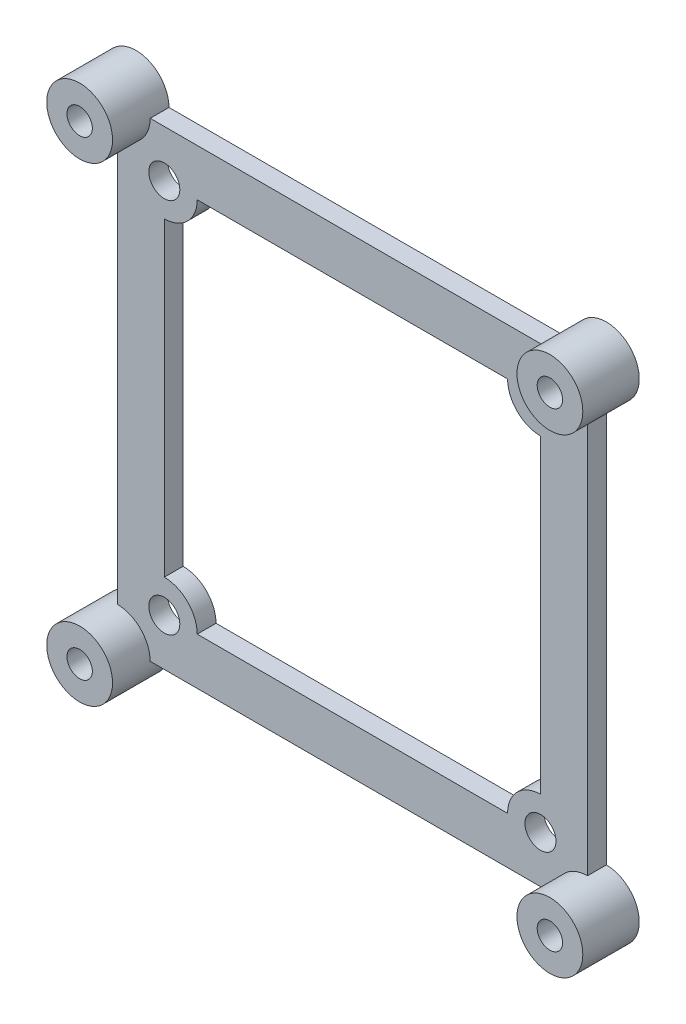
ISO-10303-21;
HEADER;
FILE_DESCRIPTION(('STEP AP214'),'2;1');
FILE_NAME('part.step','',(''),(''),'','','');
FILE_SCHEMA(('AUTOMOTIVE_DESIGN { 1 0 10303 214 1 1 1 1 }'));
ENDSEC;
DATA;
#1=APPLICATION_CONTEXT('core data for automotive mechanical design processes');
#2=APPLICATION_PROTOCOL_DEFINITION('international standard','automotive_design',2000,#1);
#3=PRODUCT_CONTEXT('',#1,'mechanical');
#4=PRODUCT('Part','Part','',(#3));
#5=PRODUCT_RELATED_PRODUCT_CATEGORY('part','',(#4));
#6=PRODUCT_DEFINITION_FORMATION('','',#4);
#7=PRODUCT_DEFINITION_CONTEXT('part definition',#1,'design');
#8=PRODUCT_DEFINITION('design','',#6,#7);
#9=PRODUCT_DEFINITION_SHAPE('','',#8);
#10=(LENGTH_UNIT() NAMED_UNIT(*) SI_UNIT(.MILLI.,.METRE.));
#11=(NAMED_UNIT(*) PLANE_ANGLE_UNIT() SI_UNIT($,.RADIAN.));
#12=(NAMED_UNIT(*) SI_UNIT($,.STERADIAN.) SOLID_ANGLE_UNIT());
#13=UNCERTAINTY_MEASURE_WITH_UNIT(LENGTH_MEASURE(1.E-05),#10,'distance_accuracy_value','');
#14=(GEOMETRIC_REPRESENTATION_CONTEXT(3) GLOBAL_UNCERTAINTY_ASSIGNED_CONTEXT((#13)) GLOBAL_UNIT_ASSIGNED_CONTEXT((#10,
#11,#12)) REPRESENTATION_CONTEXT('',''));
#15=CARTESIAN_POINT('',(0.,0.,0.));
#16=DIRECTION('',(0.,0.,1.));
#17=DIRECTION('',(1.,0.,0.));
#18=AXIS2_PLACEMENT_3D('',#15,#16,#17);
#19=CARTESIAN_POINT('',(-25.,25.,2.));
#20=DIRECTION('',(0.,0.,1.));
#21=DIRECTION('',(1.,0.,0.));
#22=AXIS2_PLACEMENT_3D('',#19,#20,#21);
#23=PLANE('',#22);
#24=DIRECTION('',(0.,-1.,0.));
#25=VECTOR('',#24,1.);
#26=CARTESIAN_POINT('',(-20.,16.5,2.));
#27=LINE('',#26,#25);
#28=CARTESIAN_POINT('',(-20.,16.5,2.));
#29=VERTEX_POINT('',#28);
#30=CARTESIAN_POINT('',(-20.,-16.5,2.));
#31=VERTEX_POINT('',#30);
#32=EDGE_CURVE('E224',#29,#31,#27,.T.);
#33=ORIENTED_EDGE('',*,*,#32,.F.);
#34=CARTESIAN_POINT('',(-20.,20.,2.));
#35=DIRECTION('',(0.,0.,-1.));
#36=DIRECTION('',(1.,0.,0.));
#37=AXIS2_PLACEMENT_3D('',#34,#35,#36);
#38=CIRCLE('',#37,3.5);
#39=CARTESIAN_POINT('',(-16.5,20.,2.));
#40=VERTEX_POINT('',#39);
#41=EDGE_CURVE('E222',#40,#29,#38,.T.);
#42=ORIENTED_EDGE('',*,*,#41,.F.);
#43=DIRECTION('',(-1.,0.,0.));
#44=VECTOR('',#43,1.);
#45=CARTESIAN_POINT('',(-16.5,20.,2.));
#46=LINE('',#45,#44);
#47=CARTESIAN_POINT('',(16.5,20.,2.));
#48=VERTEX_POINT('',#47);
#49=EDGE_CURVE('E237',#48,#40,#46,.T.);
#50=ORIENTED_EDGE('',*,*,#49,.F.);
#51=CARTESIAN_POINT('',(20.,20.,2.));
#52=DIRECTION('',(0.,0.,-1.));
#53=DIRECTION('',(1.,0.,0.));
#54=AXIS2_PLACEMENT_3D('',#51,#52,#53);
#55=CIRCLE('',#54,3.5);
#56=CARTESIAN_POINT('',(20.,16.5,2.));
#57=VERTEX_POINT('',#56);
#58=EDGE_CURVE('E235',#57,#48,#55,.T.);
#59=ORIENTED_EDGE('',*,*,#58,.F.);
#60=DIRECTION('',(0.,1.,0.));
#61=VECTOR('',#60,1.);
#62=CARTESIAN_POINT('',(20.,16.5,2.));
#63=LINE('',#62,#61);
#64=CARTESIAN_POINT('',(20.,-16.5,2.));
#65=VERTEX_POINT('',#64);
#66=EDGE_CURVE('E233',#65,#57,#63,.T.);
#67=ORIENTED_EDGE('',*,*,#66,.F.);
#68=CARTESIAN_POINT('',(20.,-20.,2.));
#69=DIRECTION('',(0.,0.,-1.));
#70=DIRECTION('',(1.,0.,0.));
#71=AXIS2_PLACEMENT_3D('',#68,#69,#70);
#72=CIRCLE('',#71,3.5);
#73=CARTESIAN_POINT('',(16.5,-20.,2.));
#74=VERTEX_POINT('',#73);
#75=EDGE_CURVE('E231',#74,#65,#72,.T.);
#76=ORIENTED_EDGE('',*,*,#75,.F.);
#77=DIRECTION('',(1.,0.,0.));
#78=VECTOR('',#77,1.);
#79=CARTESIAN_POINT('',(-16.5,-20.,2.));
#80=LINE('',#79,#78);
#81=CARTESIAN_POINT('',(-16.5,-20.,2.));
#82=VERTEX_POINT('',#81);
#83=EDGE_CURVE('E229',#82,#74,#80,.T.);
#84=ORIENTED_EDGE('',*,*,#83,.F.);
#85=CARTESIAN_POINT('',(-20.,-20.,2.));
#86=DIRECTION('',(0.,0.,-1.));
#87=DIRECTION('',(1.,0.,0.));
#88=AXIS2_PLACEMENT_3D('',#85,#86,#87);
#89=CIRCLE('',#88,3.5);
#90=EDGE_CURVE('E227',#31,#82,#89,.T.);
#91=ORIENTED_EDGE('',*,*,#90,.F.);
#92=EDGE_LOOP('',(#33,#42,#50,#59,#67,#76,#84,#91));
#93=FACE_BOUND('',#92,.T.);
#94=CARTESIAN_POINT('',(20.,-20.,2.));
#95=DIRECTION('',(0.,0.,1.));
#96=DIRECTION('',(1.,0.,0.));
#97=AXIS2_PLACEMENT_3D('',#94,#95,#96);
#98=CIRCLE('',#97,1.65);
#99=CARTESIAN_POINT('',(21.65,-20.,2.));
#100=VERTEX_POINT('',#99);
#101=EDGE_CURVE('E282',#100,#100,#98,.T.);
#102=ORIENTED_EDGE('',*,*,#101,.F.);
#103=EDGE_LOOP('',(#102));
#104=FACE_BOUND('',#103,.T.);
#105=CARTESIAN_POINT('',(-20.,20.,2.));
#106=DIRECTION('',(0.,0.,1.));
#107=DIRECTION('',(1.,0.,0.));
#108=AXIS2_PLACEMENT_3D('',#105,#106,#107);
#109=CIRCLE('',#108,1.65);
#110=CARTESIAN_POINT('',(-18.35,20.,2.));
#111=VERTEX_POINT('',#110);
#112=EDGE_CURVE('E294',#111,#111,#109,.T.);
#113=ORIENTED_EDGE('',*,*,#112,.F.);
#114=EDGE_LOOP('',(#113));
#115=FACE_BOUND('',#114,.T.);
#116=CARTESIAN_POINT('',(20.,20.,2.));
#117=DIRECTION('',(0.,0.,1.));
#118=DIRECTION('',(1.,0.,0.));
#119=AXIS2_PLACEMENT_3D('',#116,#117,#118);
#120=CIRCLE('',#119,1.65);
#121=CARTESIAN_POINT('',(21.65,20.,2.));
#122=VERTEX_POINT('',#121);
#123=EDGE_CURVE('E288',#122,#122,#120,.T.);
#124=ORIENTED_EDGE('',*,*,#123,.F.);
#125=EDGE_LOOP('',(#124));
#126=FACE_BOUND('',#125,.T.);
#127=CARTESIAN_POINT('',(-20.,-20.,2.));
#128=DIRECTION('',(0.,0.,1.));
#129=DIRECTION('',(1.,0.,0.));
#130=AXIS2_PLACEMENT_3D('',#127,#128,#129);
#131=CIRCLE('',#130,1.65);
#132=CARTESIAN_POINT('',(-18.35,-20.,2.));
#133=VERTEX_POINT('',#132);
#134=EDGE_CURVE('E276',#133,#133,#131,.T.);
#135=ORIENTED_EDGE('',*,*,#134,.F.);
#136=EDGE_LOOP('',(#135));
#137=FACE_BOUND('',#136,.T.);
#138=DIRECTION('',(1.,0.,0.));
#139=VECTOR('',#138,1.);
#140=CARTESIAN_POINT('',(-21.5,-25.,2.));
#141=LINE('',#140,#139);
#142=CARTESIAN_POINT('',(-21.5,-25.,2.));
#143=VERTEX_POINT('',#142);
#144=CARTESIAN_POINT('',(21.5,-25.,2.));
#145=VERTEX_POINT('',#144);
#146=EDGE_CURVE('E185',#143,#145,#141,.T.);
#147=ORIENTED_EDGE('',*,*,#146,.T.);
#148=CARTESIAN_POINT('',(25.,-25.,2.));
#149=DIRECTION('',(0.,0.,1.));
#150=DIRECTION('',(1.,0.,0.));
#151=AXIS2_PLACEMENT_3D('',#148,#149,#150);
#152=CIRCLE('',#151,3.5);
#153=CARTESIAN_POINT('',(25.,-21.5,2.));
#154=VERTEX_POINT('',#153);
#155=EDGE_CURVE('E192',#154,#145,#152,.T.);
#156=ORIENTED_EDGE('',*,*,#155,.F.);
#157=DIRECTION('',(0.,1.,0.));
#158=VECTOR('',#157,1.);
#159=CARTESIAN_POINT('',(25.,21.5,2.));
#160=LINE('',#159,#158);
#161=CARTESIAN_POINT('',(25.,21.5,2.));
#162=VERTEX_POINT('',#161);
#163=EDGE_CURVE('E173',#154,#162,#160,.T.);
#164=ORIENTED_EDGE('',*,*,#163,.T.);
#165=CARTESIAN_POINT('',(25.,25.,2.));
#166=DIRECTION('',(0.,0.,1.));
#167=DIRECTION('',(1.,0.,0.));
#168=AXIS2_PLACEMENT_3D('',#165,#166,#167);
#169=CIRCLE('',#168,3.5);
#170=CARTESIAN_POINT('',(21.5,25.,2.));
#171=VERTEX_POINT('',#170);
#172=EDGE_CURVE('E212',#171,#162,#169,.T.);
#173=ORIENTED_EDGE('',*,*,#172,.F.);
#174=DIRECTION('',(-1.,0.,0.));
#175=VECTOR('',#174,1.);
#176=CARTESIAN_POINT('',(-21.5,25.,2.));
#177=LINE('',#176,#175);
#178=CARTESIAN_POINT('',(-21.5,25.,2.));
#179=VERTEX_POINT('',#178);
#180=EDGE_CURVE('E184',#171,#179,#177,.T.);
#181=ORIENTED_EDGE('',*,*,#180,.T.);
#182=CARTESIAN_POINT('',(-25.,25.,2.));
#183=DIRECTION('',(0.,0.,1.));
#184=DIRECTION('',(1.,0.,0.));
#185=AXIS2_PLACEMENT_3D('',#182,#183,#184);
#186=CIRCLE('',#185,3.5);
#187=CARTESIAN_POINT('',(-25.,21.5,2.));
#188=VERTEX_POINT('',#187);
#189=EDGE_CURVE('E12',#188,#179,#186,.T.);
#190=ORIENTED_EDGE('',*,*,#189,.F.);
#191=DIRECTION('',(0.,-1.,0.));
#192=VECTOR('',#191,1.);
#193=CARTESIAN_POINT('',(-25.,21.5,2.));
#194=LINE('',#193,#192);
#195=CARTESIAN_POINT('',(-25.,-21.5,2.));
#196=VERTEX_POINT('',#195);
#197=EDGE_CURVE('E300',#188,#196,#194,.T.);
#198=ORIENTED_EDGE('',*,*,#197,.T.);
#199=CARTESIAN_POINT('',(-25.,-25.,2.));
#200=DIRECTION('',(0.,0.,1.));
#201=DIRECTION('',(1.,0.,0.));
#202=AXIS2_PLACEMENT_3D('',#199,#200,#201);
#203=CIRCLE('',#202,3.5);
#204=EDGE_CURVE('E203',#143,#196,#203,.T.);
#205=ORIENTED_EDGE('',*,*,#204,.F.);
#206=EDGE_LOOP('',(#147,#156,#164,#173,#181,#190,#198,#205));
#207=FACE_BOUND('',#206,.T.);
#208=ADVANCED_FACE('F57',(#93,#104,#115,#126,#137,#207),#23,.T.);
#209=CARTESIAN_POINT('',(-25.,25.,0.));
#210=DIRECTION('',(0.,0.,1.));
#211=DIRECTION('',(1.,0.,0.));
#212=AXIS2_PLACEMENT_3D('',#209,#210,#211);
#213=PLANE('',#212);
#214=CARTESIAN_POINT('',(-20.,-20.,0.));
#215=DIRECTION('',(0.,0.,1.));
#216=DIRECTION('',(1.,0.,0.));
#217=AXIS2_PLACEMENT_3D('',#214,#215,#216);
#218=CIRCLE('',#217,1.65);
#219=CARTESIAN_POINT('',(-18.35,-20.,0.));
#220=VERTEX_POINT('',#219);
#221=EDGE_CURVE('E275',#220,#220,#218,.T.);
#222=ORIENTED_EDGE('',*,*,#221,.T.);
#223=EDGE_LOOP('',(#222));
#224=FACE_BOUND('',#223,.T.);
#225=CARTESIAN_POINT('',(20.,-20.,0.));
#226=DIRECTION('',(0.,0.,1.));
#227=DIRECTION('',(1.,0.,0.));
#228=AXIS2_PLACEMENT_3D('',#225,#226,#227);
#229=CIRCLE('',#228,1.65);
#230=CARTESIAN_POINT('',(21.65,-20.,0.));
#231=VERTEX_POINT('',#230);
#232=EDGE_CURVE('E279',#231,#231,#229,.T.);
#233=ORIENTED_EDGE('',*,*,#232,.T.);
#234=EDGE_LOOP('',(#233));
#235=FACE_BOUND('',#234,.T.);
#236=CARTESIAN_POINT('',(20.,20.,0.));
#237=DIRECTION('',(0.,0.,1.));
#238=DIRECTION('',(1.,0.,0.));
#239=AXIS2_PLACEMENT_3D('',#236,#237,#238);
#240=CIRCLE('',#239,1.65);
#241=CARTESIAN_POINT('',(21.65,20.,0.));
#242=VERTEX_POINT('',#241);
#243=EDGE_CURVE('E285',#242,#242,#240,.T.);
#244=ORIENTED_EDGE('',*,*,#243,.T.);
#245=EDGE_LOOP('',(#244));
#246=FACE_BOUND('',#245,.T.);
#247=CARTESIAN_POINT('',(-20.,20.,0.));
#248=DIRECTION('',(0.,0.,1.));
#249=DIRECTION('',(1.,0.,0.));
#250=AXIS2_PLACEMENT_3D('',#247,#248,#249);
#251=CIRCLE('',#250,1.65);
#252=CARTESIAN_POINT('',(-18.35,20.,0.));
#253=VERTEX_POINT('',#252);
#254=EDGE_CURVE('E291',#253,#253,#251,.T.);
#255=ORIENTED_EDGE('',*,*,#254,.T.);
#256=EDGE_LOOP('',(#255));
#257=FACE_BOUND('',#256,.T.);
#258=CARTESIAN_POINT('',(-25.,25.,0.));
#259=DIRECTION('',(0.,0.,1.));
#260=DIRECTION('',(1.,0.,0.));
#261=AXIS2_PLACEMENT_3D('',#258,#259,#260);
#262=CIRCLE('',#261,3.5);
#263=CARTESIAN_POINT('',(-21.5,25.,0.));
#264=VERTEX_POINT('',#263);
#265=CARTESIAN_POINT('',(-25.,21.5,0.));
#266=VERTEX_POINT('',#265);
#267=EDGE_CURVE('E297',#264,#266,#262,.T.);
#268=ORIENTED_EDGE('',*,*,#267,.F.);
#269=DIRECTION('',(-1.,0.,0.));
#270=VECTOR('',#269,1.);
#271=CARTESIAN_POINT('',(-21.5,25.,0.));
#272=LINE('',#271,#270);
#273=CARTESIAN_POINT('',(21.5,25.,0.));
#274=VERTEX_POINT('',#273);
#275=EDGE_CURVE('E302',#274,#264,#272,.T.);
#276=ORIENTED_EDGE('',*,*,#275,.F.);
#277=CARTESIAN_POINT('',(25.,25.,0.));
#278=DIRECTION('',(0.,0.,1.));
#279=DIRECTION('',(1.,0.,0.));
#280=AXIS2_PLACEMENT_3D('',#277,#278,#279);
#281=CIRCLE('',#280,3.5);
#282=CARTESIAN_POINT('',(25.,21.5,0.));
#283=VERTEX_POINT('',#282);
#284=EDGE_CURVE('E318',#283,#274,#281,.T.);
#285=ORIENTED_EDGE('',*,*,#284,.F.);
#286=DIRECTION('',(0.,1.,0.));
#287=VECTOR('',#286,1.);
#288=CARTESIAN_POINT('',(25.,21.5,0.));
#289=LINE('',#288,#287);
#290=CARTESIAN_POINT('',(25.,-21.5,0.));
#291=VERTEX_POINT('',#290);
#292=EDGE_CURVE('E316',#291,#283,#289,.T.);
#293=ORIENTED_EDGE('',*,*,#292,.F.);
#294=CARTESIAN_POINT('',(25.,-25.,0.));
#295=DIRECTION('',(0.,0.,1.));
#296=DIRECTION('',(1.,0.,0.));
#297=AXIS2_PLACEMENT_3D('',#294,#295,#296);
#298=CIRCLE('',#297,3.5);
#299=CARTESIAN_POINT('',(21.5,-25.,0.));
#300=VERTEX_POINT('',#299);
#301=EDGE_CURVE('E194',#300,#291,#298,.T.);
#302=ORIENTED_EDGE('',*,*,#301,.F.);
#303=DIRECTION('',(1.,0.,0.));
#304=VECTOR('',#303,1.);
#305=CARTESIAN_POINT('',(-21.5,-25.,0.));
#306=LINE('',#305,#304);
#307=CARTESIAN_POINT('',(-21.5,-25.,0.));
#308=VERTEX_POINT('',#307);
#309=EDGE_CURVE('E313',#308,#300,#306,.T.);
#310=ORIENTED_EDGE('',*,*,#309,.F.);
#311=CARTESIAN_POINT('',(-25.,-25.,0.));
#312=DIRECTION('',(0.,0.,1.));
#313=DIRECTION('',(1.,0.,0.));
#314=AXIS2_PLACEMENT_3D('',#311,#312,#313);
#315=CIRCLE('',#314,3.5);
#316=CARTESIAN_POINT('',(-25.,-21.5,0.));
#317=VERTEX_POINT('',#316);
#318=EDGE_CURVE('E311',#317,#308,#315,.T.);
#319=ORIENTED_EDGE('',*,*,#318,.F.);
#320=DIRECTION('',(0.,-1.,0.));
#321=VECTOR('',#320,1.);
#322=CARTESIAN_POINT('',(-25.,21.5,0.));
#323=LINE('',#322,#321);
#324=EDGE_CURVE('E309',#266,#317,#323,.T.);
#325=ORIENTED_EDGE('',*,*,#324,.F.);
#326=EDGE_LOOP('',(#268,#276,#285,#293,#302,#310,#319,#325));
#327=FACE_BOUND('',#326,.T.);
#328=CARTESIAN_POINT('',(-20.,20.,0.));
#329=DIRECTION('',(0.,0.,-1.));
#330=DIRECTION('',(1.,0.,0.));
#331=AXIS2_PLACEMENT_3D('',#328,#329,#330);
#332=CIRCLE('',#331,3.5);
#333=CARTESIAN_POINT('',(-16.5,20.,0.));
#334=VERTEX_POINT('',#333);
#335=CARTESIAN_POINT('',(-20.,16.5,0.));
#336=VERTEX_POINT('',#335);
#337=EDGE_CURVE('E81',#334,#336,#332,.T.);
#338=ORIENTED_EDGE('',*,*,#337,.T.);
#339=DIRECTION('',(0.,-1.,0.));
#340=VECTOR('',#339,1.);
#341=CARTESIAN_POINT('',(-20.,16.5,0.));
#342=LINE('',#341,#340);
#343=CARTESIAN_POINT('',(-20.,-16.5,0.));
#344=VERTEX_POINT('',#343);
#345=EDGE_CURVE('E241',#336,#344,#342,.T.);
#346=ORIENTED_EDGE('',*,*,#345,.T.);
#347=CARTESIAN_POINT('',(-20.,-20.,0.));
#348=DIRECTION('',(0.,0.,-1.));
#349=DIRECTION('',(1.,0.,0.));
#350=AXIS2_PLACEMENT_3D('',#347,#348,#349);
#351=CIRCLE('',#350,3.5);
#352=CARTESIAN_POINT('',(-16.5,-20.,0.));
#353=VERTEX_POINT('',#352);
#354=EDGE_CURVE('E244',#344,#353,#351,.T.);
#355=ORIENTED_EDGE('',*,*,#354,.T.);
#356=DIRECTION('',(1.,0.,0.));
#357=VECTOR('',#356,1.);
#358=CARTESIAN_POINT('',(-16.5,-20.,0.));
#359=LINE('',#358,#357);
#360=CARTESIAN_POINT('',(16.5,-20.,0.));
#361=VERTEX_POINT('',#360);
#362=EDGE_CURVE('E247',#353,#361,#359,.T.);
#363=ORIENTED_EDGE('',*,*,#362,.T.);
#364=CARTESIAN_POINT('',(20.,-20.,0.));
#365=DIRECTION('',(0.,0.,-1.));
#366=DIRECTION('',(1.,0.,0.));
#367=AXIS2_PLACEMENT_3D('',#364,#365,#366);
#368=CIRCLE('',#367,3.5);
#369=CARTESIAN_POINT('',(20.,-16.5,0.));
#370=VERTEX_POINT('',#369);
#371=EDGE_CURVE('E250',#361,#370,#368,.T.);
#372=ORIENTED_EDGE('',*,*,#371,.T.);
#373=DIRECTION('',(0.,1.,0.));
#374=VECTOR('',#373,1.);
#375=CARTESIAN_POINT('',(20.,16.5,0.));
#376=LINE('',#375,#374);
#377=CARTESIAN_POINT('',(20.,16.5,0.));
#378=VERTEX_POINT('',#377);
#379=EDGE_CURVE('E253',#370,#378,#376,.T.);
#380=ORIENTED_EDGE('',*,*,#379,.T.);
#381=CARTESIAN_POINT('',(20.,20.,0.));
#382=DIRECTION('',(0.,0.,-1.));
#383=DIRECTION('',(1.,0.,0.));
#384=AXIS2_PLACEMENT_3D('',#381,#382,#383);
#385=CIRCLE('',#384,3.5);
#386=CARTESIAN_POINT('',(16.5,20.,0.));
#387=VERTEX_POINT('',#386);
#388=EDGE_CURVE('E256',#378,#387,#385,.T.);
#389=ORIENTED_EDGE('',*,*,#388,.T.);
#390=DIRECTION('',(-1.,0.,0.));
#391=VECTOR('',#390,1.);
#392=CARTESIAN_POINT('',(-16.5,20.,0.));
#393=LINE('',#392,#391);
#394=EDGE_CURVE('E225',#387,#334,#393,.T.);
#395=ORIENTED_EDGE('',*,*,#394,.T.);
#396=EDGE_LOOP('',(#338,#346,#355,#363,#372,#380,#389,#395));
#397=FACE_BOUND('',#396,.T.);
#398=CARTESIAN_POINT('',(25.,25.,0.));
#399=DIRECTION('',(0.,0.,1.));
#400=DIRECTION('',(1.,0.,0.));
#401=AXIS2_PLACEMENT_3D('',#398,#399,#400);
#402=CIRCLE('',#401,1.35);
#403=CARTESIAN_POINT('',(26.35,25.,0.));
#404=VERTEX_POINT('',#403);
#405=EDGE_CURVE('E200',#404,#404,#402,.F.);
#406=ORIENTED_EDGE('',*,*,#405,.F.);
#407=EDGE_LOOP('',(#406));
#408=FACE_BOUND('',#407,.T.);
#409=CARTESIAN_POINT('',(25.,-25.,0.));
#410=DIRECTION('',(0.,0.,1.));
#411=DIRECTION('',(1.,0.,0.));
#412=AXIS2_PLACEMENT_3D('',#409,#410,#411);
#413=CIRCLE('',#412,1.35);
#414=CARTESIAN_POINT('',(26.35,-25.,0.));
#415=VERTEX_POINT('',#414);
#416=EDGE_CURVE('E477',#415,#415,#413,.F.);
#417=ORIENTED_EDGE('',*,*,#416,.F.);
#418=EDGE_LOOP('',(#417));
#419=FACE_BOUND('',#418,.T.);
#420=CARTESIAN_POINT('',(-25.,-25.,0.));
#421=DIRECTION('',(0.,0.,1.));
#422=DIRECTION('',(1.,0.,0.));
#423=AXIS2_PLACEMENT_3D('',#420,#421,#422);
#424=CIRCLE('',#423,1.35);
#425=CARTESIAN_POINT('',(-23.65,-25.,0.));
#426=VERTEX_POINT('',#425);
#427=EDGE_CURVE('E471',#426,#426,#424,.F.);
#428=ORIENTED_EDGE('',*,*,#427,.F.);
#429=EDGE_LOOP('',(#428));
#430=FACE_BOUND('',#429,.T.);
#431=CARTESIAN_POINT('',(-25.,25.,0.));
#432=DIRECTION('',(0.,0.,1.));
#433=DIRECTION('',(1.,0.,0.));
#434=AXIS2_PLACEMENT_3D('',#431,#432,#433);
#435=CIRCLE('',#434,1.35);
#436=CARTESIAN_POINT('',(-23.65,25.,0.));
#437=VERTEX_POINT('',#436);
#438=EDGE_CURVE('E460',#437,#437,#435,.F.);
#439=ORIENTED_EDGE('',*,*,#438,.F.);
#440=EDGE_LOOP('',(#439));
#441=FACE_BOUND('',#440,.T.);
#442=ADVANCED_FACE('F345',(#224,#235,#246,#257,#327,#397,#408,#419,#430,#441),#213,.F.);
#443=CARTESIAN_POINT('',(-25.,25.,2.));
#444=DIRECTION('',(0.,0.,-1.));
#445=DIRECTION('',(-1.,0.,0.));
#446=AXIS2_PLACEMENT_3D('',#443,#444,#445);
#447=CYLINDRICAL_SURFACE('',#446,3.5);
#448=ORIENTED_EDGE('',*,*,#267,.T.);
#449=DIRECTION('',(0.,0.,-1.));
#450=VECTOR('',#449,1.);
#451=CARTESIAN_POINT('',(-25.,21.5,2.));
#452=LINE('',#451,#450);
#453=EDGE_CURVE('E61',#188,#266,#452,.T.);
#454=ORIENTED_EDGE('',*,*,#453,.F.);
#455=ORIENTED_EDGE('',*,*,#189,.T.);
#456=DIRECTION('',(0.,0.,-1.));
#457=VECTOR('',#456,1.);
#458=CARTESIAN_POINT('',(-21.5,25.,2.));
#459=LINE('',#458,#457);
#460=EDGE_CURVE('E306',#179,#264,#459,.T.);
#461=ORIENTED_EDGE('',*,*,#460,.T.);
#462=EDGE_LOOP('',(#448,#454,#455,#461));
#463=FACE_BOUND('',#462,.T.);
#464=CARTESIAN_POINT('',(-25.,25.,6.));
#465=DIRECTION('',(0.,0.,1.));
#466=DIRECTION('',(1.,0.,0.));
#467=AXIS2_PLACEMENT_3D('',#464,#465,#466);
#468=CIRCLE('',#467,3.5);
#469=CARTESIAN_POINT('',(-21.5,25.,6.));
#470=VERTEX_POINT('',#469);
#471=EDGE_CURVE('E218',#470,#470,#468,.T.);
#472=ORIENTED_EDGE('',*,*,#471,.F.);
#473=EDGE_LOOP('',(#472));
#474=FACE_BOUND('',#473,.T.);
#475=ADVANCED_FACE('F59',(#463,#474),#447,.T.);
#476=CARTESIAN_POINT('',(-25.,21.5,2.));
#477=DIRECTION('',(1.,0.,0.));
#478=DIRECTION('',(0.,1.,0.));
#479=AXIS2_PLACEMENT_3D('',#476,#477,#478);
#480=PLANE('',#479);
#481=ORIENTED_EDGE('',*,*,#324,.T.);
#482=DIRECTION('',(0.,0.,-1.));
#483=VECTOR('',#482,1.);
#484=CARTESIAN_POINT('',(-25.,-21.5,2.));
#485=LINE('',#484,#483);
#486=EDGE_CURVE('E330',#196,#317,#485,.T.);
#487=ORIENTED_EDGE('',*,*,#486,.F.);
#488=ORIENTED_EDGE('',*,*,#197,.F.);
#489=ORIENTED_EDGE('',*,*,#453,.T.);
#490=EDGE_LOOP('',(#481,#487,#488,#489));
#491=FACE_BOUND('',#490,.T.);
#492=ADVANCED_FACE('F339',(#491),#480,.F.);
#493=CARTESIAN_POINT('',(-25.,-25.,2.));
#494=DIRECTION('',(0.,0.,-1.));
#495=DIRECTION('',(-1.,0.,0.));
#496=AXIS2_PLACEMENT_3D('',#493,#494,#495);
#497=CYLINDRICAL_SURFACE('',#496,3.5);
#498=ORIENTED_EDGE('',*,*,#318,.T.);
#499=DIRECTION('',(0.,0.,-1.));
#500=VECTOR('',#499,1.);
#501=CARTESIAN_POINT('',(-21.5,-25.,2.));
#502=LINE('',#501,#500);
#503=EDGE_CURVE('E328',#143,#308,#502,.T.);
#504=ORIENTED_EDGE('',*,*,#503,.F.);
#505=ORIENTED_EDGE('',*,*,#204,.T.);
#506=ORIENTED_EDGE('',*,*,#486,.T.);
#507=EDGE_LOOP('',(#498,#504,#505,#506));
#508=FACE_BOUND('',#507,.T.);
#509=CARTESIAN_POINT('',(-25.,-25.,6.));
#510=DIRECTION('',(0.,0.,1.));
#511=DIRECTION('',(1.,0.,0.));
#512=AXIS2_PLACEMENT_3D('',#509,#510,#511);
#513=CIRCLE('',#512,3.5);
#514=CARTESIAN_POINT('',(-21.5,-25.,6.));
#515=VERTEX_POINT('',#514);
#516=EDGE_CURVE('E209',#515,#515,#513,.T.);
#517=ORIENTED_EDGE('',*,*,#516,.F.);
#518=EDGE_LOOP('',(#517));
#519=FACE_BOUND('',#518,.T.);
#520=ADVANCED_FACE('F350',(#508,#519),#497,.T.);
#521=CARTESIAN_POINT('',(-21.5,-25.,2.));
#522=DIRECTION('',(0.,1.,0.));
#523=DIRECTION('',(-1.,0.,0.));
#524=AXIS2_PLACEMENT_3D('',#521,#522,#523);
#525=PLANE('',#524);
#526=ORIENTED_EDGE('',*,*,#309,.T.);
#527=DIRECTION('',(0.,0.,-1.));
#528=VECTOR('',#527,1.);
#529=CARTESIAN_POINT('',(21.5,-25.,2.));
#530=LINE('',#529,#528);
#531=EDGE_CURVE('E195',#145,#300,#530,.T.);
#532=ORIENTED_EDGE('',*,*,#531,.F.);
#533=ORIENTED_EDGE('',*,*,#146,.F.);
#534=ORIENTED_EDGE('',*,*,#503,.T.);
#535=EDGE_LOOP('',(#526,#532,#533,#534));
#536=FACE_BOUND('',#535,.T.);
#537=ADVANCED_FACE('F353',(#536),#525,.F.);
#538=CARTESIAN_POINT('',(25.,-25.,2.));
#539=DIRECTION('',(0.,0.,-1.));
#540=DIRECTION('',(-1.,0.,0.));
#541=AXIS2_PLACEMENT_3D('',#538,#539,#540);
#542=CYLINDRICAL_SURFACE('',#541,3.5);
#543=ORIENTED_EDGE('',*,*,#301,.T.);
#544=DIRECTION('',(0.,0.,-1.));
#545=VECTOR('',#544,1.);
#546=CARTESIAN_POINT('',(25.,-21.5,2.));
#547=LINE('',#546,#545);
#548=EDGE_CURVE('E176',#154,#291,#547,.T.);
#549=ORIENTED_EDGE('',*,*,#548,.F.);
#550=ORIENTED_EDGE('',*,*,#155,.T.);
#551=ORIENTED_EDGE('',*,*,#531,.T.);
#552=EDGE_LOOP('',(#543,#549,#550,#551));
#553=FACE_BOUND('',#552,.T.);
#554=CARTESIAN_POINT('',(25.,-25.,6.));
#555=DIRECTION('',(0.,0.,1.));
#556=DIRECTION('',(1.,0.,0.));
#557=AXIS2_PLACEMENT_3D('',#554,#555,#556);
#558=CIRCLE('',#557,3.5);
#559=CARTESIAN_POINT('',(28.5,-25.,6.));
#560=VERTEX_POINT('',#559);
#561=EDGE_CURVE('E199',#560,#560,#558,.T.);
#562=ORIENTED_EDGE('',*,*,#561,.F.);
#563=EDGE_LOOP('',(#562));
#564=FACE_BOUND('',#563,.T.);
#565=ADVANCED_FACE('F189',(#553,#564),#542,.T.);
#566=CARTESIAN_POINT('',(25.,21.5,2.));
#567=DIRECTION('',(-1.,0.,0.));
#568=DIRECTION('',(0.,-1.,0.));
#569=AXIS2_PLACEMENT_3D('',#566,#567,#568);
#570=PLANE('',#569);
#571=ORIENTED_EDGE('',*,*,#292,.T.);
#572=DIRECTION('',(0.,0.,-1.));
#573=VECTOR('',#572,1.);
#574=CARTESIAN_POINT('',(25.,21.5,2.));
#575=LINE('',#574,#573);
#576=EDGE_CURVE('E179',#162,#283,#575,.T.);
#577=ORIENTED_EDGE('',*,*,#576,.F.);
#578=ORIENTED_EDGE('',*,*,#163,.F.);
#579=ORIENTED_EDGE('',*,*,#548,.T.);
#580=EDGE_LOOP('',(#571,#577,#578,#579));
#581=FACE_BOUND('',#580,.T.);
#582=ADVANCED_FACE('F175',(#581),#570,.F.);
#583=CARTESIAN_POINT('',(25.,25.,2.));
#584=DIRECTION('',(0.,0.,-1.));
#585=DIRECTION('',(-1.,0.,0.));
#586=AXIS2_PLACEMENT_3D('',#583,#584,#585);
#587=CYLINDRICAL_SURFACE('',#586,3.5);
#588=ORIENTED_EDGE('',*,*,#284,.T.);
#589=DIRECTION('',(0.,0.,-1.));
#590=VECTOR('',#589,1.);
#591=CARTESIAN_POINT('',(21.5,25.,2.));
#592=LINE('',#591,#590);
#593=EDGE_CURVE('E323',#171,#274,#592,.T.);
#594=ORIENTED_EDGE('',*,*,#593,.F.);
#595=ORIENTED_EDGE('',*,*,#172,.T.);
#596=ORIENTED_EDGE('',*,*,#576,.T.);
#597=EDGE_LOOP('',(#588,#594,#595,#596));
#598=FACE_BOUND('',#597,.T.);
#599=CARTESIAN_POINT('',(25.,25.,6.));
#600=DIRECTION('',(0.,0.,1.));
#601=DIRECTION('',(1.,0.,0.));
#602=AXIS2_PLACEMENT_3D('',#599,#600,#601);
#603=CIRCLE('',#602,3.5);
#604=CARTESIAN_POINT('',(28.5,25.,6.));
#605=VERTEX_POINT('',#604);
#606=EDGE_CURVE('E215',#605,#605,#603,.T.);
#607=ORIENTED_EDGE('',*,*,#606,.F.);
#608=EDGE_LOOP('',(#607));
#609=FACE_BOUND('',#608,.T.);
#610=ADVANCED_FACE('F355',(#598,#609),#587,.T.);
#611=CARTESIAN_POINT('',(-21.5,25.,2.));
#612=DIRECTION('',(0.,-1.,0.));
#613=DIRECTION('',(1.,0.,0.));
#614=AXIS2_PLACEMENT_3D('',#611,#612,#613);
#615=PLANE('',#614);
#616=ORIENTED_EDGE('',*,*,#275,.T.);
#617=ORIENTED_EDGE('',*,*,#460,.F.);
#618=ORIENTED_EDGE('',*,*,#180,.F.);
#619=ORIENTED_EDGE('',*,*,#593,.T.);
#620=EDGE_LOOP('',(#616,#617,#618,#619));
#621=FACE_BOUND('',#620,.T.);
#622=ADVANCED_FACE('F359',(#621),#615,.F.);
#623=CARTESIAN_POINT('',(-20.,20.,2.));
#624=DIRECTION('',(0.,0.,-1.));
#625=DIRECTION('',(-1.,0.,0.));
#626=AXIS2_PLACEMENT_3D('',#623,#624,#625);
#627=CYLINDRICAL_SURFACE('',#626,1.65);
#628=ORIENTED_EDGE('',*,*,#112,.T.);
#629=EDGE_LOOP('',(#628));
#630=FACE_BOUND('',#629,.T.);
#631=ORIENTED_EDGE('',*,*,#254,.F.);
#632=EDGE_LOOP('',(#631));
#633=FACE_BOUND('',#632,.T.);
#634=ADVANCED_FACE('F361',(#630,#633),#627,.F.);
#635=CARTESIAN_POINT('',(20.,20.,2.));
#636=DIRECTION('',(0.,0.,-1.));
#637=DIRECTION('',(-1.,0.,0.));
#638=AXIS2_PLACEMENT_3D('',#635,#636,#637);
#639=CYLINDRICAL_SURFACE('',#638,1.65);
#640=ORIENTED_EDGE('',*,*,#123,.T.);
#641=EDGE_LOOP('',(#640));
#642=FACE_BOUND('',#641,.T.);
#643=ORIENTED_EDGE('',*,*,#243,.F.);
#644=EDGE_LOOP('',(#643));
#645=FACE_BOUND('',#644,.T.);
#646=ADVANCED_FACE('F367',(#642,#645),#639,.F.);
#647=CARTESIAN_POINT('',(20.,-20.,2.));
#648=DIRECTION('',(0.,0.,-1.));
#649=DIRECTION('',(-1.,0.,0.));
#650=AXIS2_PLACEMENT_3D('',#647,#648,#649);
#651=CYLINDRICAL_SURFACE('',#650,1.65);
#652=ORIENTED_EDGE('',*,*,#101,.T.);
#653=EDGE_LOOP('',(#652));
#654=FACE_BOUND('',#653,.T.);
#655=ORIENTED_EDGE('',*,*,#232,.F.);
#656=EDGE_LOOP('',(#655));
#657=FACE_BOUND('',#656,.T.);
#658=ADVANCED_FACE('F385',(#654,#657),#651,.F.);
#659=CARTESIAN_POINT('',(-20.,-20.,2.));
#660=DIRECTION('',(0.,0.,-1.));
#661=DIRECTION('',(-1.,0.,0.));
#662=AXIS2_PLACEMENT_3D('',#659,#660,#661);
#663=CYLINDRICAL_SURFACE('',#662,1.65);
#664=ORIENTED_EDGE('',*,*,#134,.T.);
#665=EDGE_LOOP('',(#664));
#666=FACE_BOUND('',#665,.T.);
#667=ORIENTED_EDGE('',*,*,#221,.F.);
#668=EDGE_LOOP('',(#667));
#669=FACE_BOUND('',#668,.T.);
#670=ADVANCED_FACE('F389',(#666,#669),#663,.F.);
#671=CARTESIAN_POINT('',(-20.,20.,2.));
#672=DIRECTION('',(0.,0.,-1.));
#673=DIRECTION('',(-1.,0.,0.));
#674=AXIS2_PLACEMENT_3D('',#671,#672,#673);
#675=CYLINDRICAL_SURFACE('',#674,3.5);
#676=ORIENTED_EDGE('',*,*,#337,.F.);
#677=DIRECTION('',(0.,0.,-1.));
#678=VECTOR('',#677,1.);
#679=CARTESIAN_POINT('',(-16.5,20.,2.));
#680=LINE('',#679,#678);
#681=EDGE_CURVE('E239',#40,#334,#680,.T.);
#682=ORIENTED_EDGE('',*,*,#681,.F.);
#683=ORIENTED_EDGE('',*,*,#41,.T.);
#684=DIRECTION('',(0.,0.,-1.));
#685=VECTOR('',#684,1.);
#686=CARTESIAN_POINT('',(-20.,16.5,2.));
#687=LINE('',#686,#685);
#688=EDGE_CURVE('E273',#29,#336,#687,.T.);
#689=ORIENTED_EDGE('',*,*,#688,.T.);
#690=EDGE_LOOP('',(#676,#682,#683,#689));
#691=FACE_BOUND('',#690,.T.);
#692=ADVANCED_FACE('F393',(#691),#675,.T.);
#693=CARTESIAN_POINT('',(-20.,16.5,2.));
#694=DIRECTION('',(1.,0.,0.));
#695=DIRECTION('',(0.,1.,0.));
#696=AXIS2_PLACEMENT_3D('',#693,#694,#695);
#697=PLANE('',#696);
#698=ORIENTED_EDGE('',*,*,#345,.F.);
#699=ORIENTED_EDGE('',*,*,#688,.F.);
#700=ORIENTED_EDGE('',*,*,#32,.T.);
#701=DIRECTION('',(0.,0.,-1.));
#702=VECTOR('',#701,1.);
#703=CARTESIAN_POINT('',(-20.,-16.5,2.));
#704=LINE('',#703,#702);
#705=EDGE_CURVE('E271',#31,#344,#704,.T.);
#706=ORIENTED_EDGE('',*,*,#705,.T.);
#707=EDGE_LOOP('',(#698,#699,#700,#706));
#708=FACE_BOUND('',#707,.T.);
#709=ADVANCED_FACE('F397',(#708),#697,.T.);
#710=CARTESIAN_POINT('',(-20.,-20.,2.));
#711=DIRECTION('',(0.,0.,-1.));
#712=DIRECTION('',(-1.,0.,0.));
#713=AXIS2_PLACEMENT_3D('',#710,#711,#712);
#714=CYLINDRICAL_SURFACE('',#713,3.5);
#715=ORIENTED_EDGE('',*,*,#354,.F.);
#716=ORIENTED_EDGE('',*,*,#705,.F.);
#717=ORIENTED_EDGE('',*,*,#90,.T.);
#718=DIRECTION('',(0.,0.,-1.));
#719=VECTOR('',#718,1.);
#720=CARTESIAN_POINT('',(-16.5,-20.,2.));
#721=LINE('',#720,#719);
#722=EDGE_CURVE('E269',#82,#353,#721,.T.);
#723=ORIENTED_EDGE('',*,*,#722,.T.);
#724=EDGE_LOOP('',(#715,#716,#717,#723));
#725=FACE_BOUND('',#724,.T.);
#726=ADVANCED_FACE('F400',(#725),#714,.T.);
#727=CARTESIAN_POINT('',(-16.5,-20.,2.));
#728=DIRECTION('',(0.,1.,0.));
#729=DIRECTION('',(-1.,0.,0.));
#730=AXIS2_PLACEMENT_3D('',#727,#728,#729);
#731=PLANE('',#730);
#732=ORIENTED_EDGE('',*,*,#362,.F.);
#733=ORIENTED_EDGE('',*,*,#722,.F.);
#734=ORIENTED_EDGE('',*,*,#83,.T.);
#735=DIRECTION('',(0.,0.,-1.));
#736=VECTOR('',#735,1.);
#737=CARTESIAN_POINT('',(16.5,-20.,2.));
#738=LINE('',#737,#736);
#739=EDGE_CURVE('E267',#74,#361,#738,.T.);
#740=ORIENTED_EDGE('',*,*,#739,.T.);
#741=EDGE_LOOP('',(#732,#733,#734,#740));
#742=FACE_BOUND('',#741,.T.);
#743=ADVANCED_FACE('F404',(#742),#731,.T.);
#744=CARTESIAN_POINT('',(20.,-20.,2.));
#745=DIRECTION('',(0.,0.,-1.));
#746=DIRECTION('',(-1.,0.,0.));
#747=AXIS2_PLACEMENT_3D('',#744,#745,#746);
#748=CYLINDRICAL_SURFACE('',#747,3.5);
#749=ORIENTED_EDGE('',*,*,#371,.F.);
#750=ORIENTED_EDGE('',*,*,#739,.F.);
#751=ORIENTED_EDGE('',*,*,#75,.T.);
#752=DIRECTION('',(0.,0.,-1.));
#753=VECTOR('',#752,1.);
#754=CARTESIAN_POINT('',(20.,-16.5,2.));
#755=LINE('',#754,#753);
#756=EDGE_CURVE('E265',#65,#370,#755,.T.);
#757=ORIENTED_EDGE('',*,*,#756,.T.);
#758=EDGE_LOOP('',(#749,#750,#751,#757));
#759=FACE_BOUND('',#758,.T.);
#760=ADVANCED_FACE('F408',(#759),#748,.T.);
#761=CARTESIAN_POINT('',(20.,16.5,2.));
#762=DIRECTION('',(-1.,0.,0.));
#763=DIRECTION('',(0.,-1.,0.));
#764=AXIS2_PLACEMENT_3D('',#761,#762,#763);
#765=PLANE('',#764);
#766=ORIENTED_EDGE('',*,*,#379,.F.);
#767=ORIENTED_EDGE('',*,*,#756,.F.);
#768=ORIENTED_EDGE('',*,*,#66,.T.);
#769=DIRECTION('',(0.,0.,-1.));
#770=VECTOR('',#769,1.);
#771=CARTESIAN_POINT('',(20.,16.5,2.));
#772=LINE('',#771,#770);
#773=EDGE_CURVE('E263',#57,#378,#772,.T.);
#774=ORIENTED_EDGE('',*,*,#773,.T.);
#775=EDGE_LOOP('',(#766,#767,#768,#774));
#776=FACE_BOUND('',#775,.T.);
#777=ADVANCED_FACE('F412',(#776),#765,.T.);
#778=CARTESIAN_POINT('',(20.,20.,2.));
#779=DIRECTION('',(0.,0.,-1.));
#780=DIRECTION('',(-1.,0.,0.));
#781=AXIS2_PLACEMENT_3D('',#778,#779,#780);
#782=CYLINDRICAL_SURFACE('',#781,3.5);
#783=ORIENTED_EDGE('',*,*,#388,.F.);
#784=ORIENTED_EDGE('',*,*,#773,.F.);
#785=ORIENTED_EDGE('',*,*,#58,.T.);
#786=DIRECTION('',(0.,0.,-1.));
#787=VECTOR('',#786,1.);
#788=CARTESIAN_POINT('',(16.5,20.,2.));
#789=LINE('',#788,#787);
#790=EDGE_CURVE('E73',#48,#387,#789,.T.);
#791=ORIENTED_EDGE('',*,*,#790,.T.);
#792=EDGE_LOOP('',(#783,#784,#785,#791));
#793=FACE_BOUND('',#792,.T.);
#794=ADVANCED_FACE('F416',(#793),#782,.T.);
#795=CARTESIAN_POINT('',(-16.5,20.,2.));
#796=DIRECTION('',(0.,-1.,0.));
#797=DIRECTION('',(1.,0.,0.));
#798=AXIS2_PLACEMENT_3D('',#795,#796,#797);
#799=PLANE('',#798);
#800=ORIENTED_EDGE('',*,*,#394,.F.);
#801=ORIENTED_EDGE('',*,*,#790,.F.);
#802=ORIENTED_EDGE('',*,*,#49,.T.);
#803=ORIENTED_EDGE('',*,*,#681,.T.);
#804=EDGE_LOOP('',(#800,#801,#802,#803));
#805=FACE_BOUND('',#804,.T.);
#806=ADVANCED_FACE('F420',(#805),#799,.T.);
#807=CARTESIAN_POINT('',(-25.,25.,6.));
#808=DIRECTION('',(0.,0.,1.));
#809=DIRECTION('',(1.,0.,0.));
#810=AXIS2_PLACEMENT_3D('',#807,#808,#809);
#811=PLANE('',#810);
#812=ORIENTED_EDGE('',*,*,#471,.T.);
#813=EDGE_LOOP('',(#812));
#814=FACE_BOUND('',#813,.T.);
#815=CARTESIAN_POINT('',(-25.,25.,6.));
#816=DIRECTION('',(0.,0.,1.));
#817=DIRECTION('',(1.,0.,0.));
#818=AXIS2_PLACEMENT_3D('',#815,#816,#817);
#819=CIRCLE('',#818,1.35);
#820=CARTESIAN_POINT('',(-23.65,25.,6.));
#821=VERTEX_POINT('',#820);
#822=EDGE_CURVE('E463',#821,#821,#819,.T.);
#823=ORIENTED_EDGE('',*,*,#822,.F.);
#824=EDGE_LOOP('',(#823));
#825=FACE_BOUND('',#824,.T.);
#826=ADVANCED_FACE('F424',(#814,#825),#811,.T.);
#827=CARTESIAN_POINT('',(25.,25.,6.));
#828=DIRECTION('',(0.,0.,1.));
#829=DIRECTION('',(1.,0.,0.));
#830=AXIS2_PLACEMENT_3D('',#827,#828,#829);
#831=PLANE('',#830);
#832=ORIENTED_EDGE('',*,*,#606,.T.);
#833=EDGE_LOOP('',(#832));
#834=FACE_BOUND('',#833,.T.);
#835=CARTESIAN_POINT('',(25.,25.,6.));
#836=DIRECTION('',(0.,0.,1.));
#837=DIRECTION('',(1.,0.,0.));
#838=AXIS2_PLACEMENT_3D('',#835,#836,#837);
#839=CIRCLE('',#838,1.35);
#840=CARTESIAN_POINT('',(26.35,25.,6.));
#841=VERTEX_POINT('',#840);
#842=EDGE_CURVE('E206',#841,#841,#839,.T.);
#843=ORIENTED_EDGE('',*,*,#842,.F.);
#844=EDGE_LOOP('',(#843));
#845=FACE_BOUND('',#844,.T.);
#846=ADVANCED_FACE('F427',(#834,#845),#831,.T.);
#847=CARTESIAN_POINT('',(-25.,-25.,6.));
#848=DIRECTION('',(0.,0.,1.));
#849=DIRECTION('',(1.,0.,0.));
#850=AXIS2_PLACEMENT_3D('',#847,#848,#849);
#851=PLANE('',#850);
#852=ORIENTED_EDGE('',*,*,#516,.T.);
#853=EDGE_LOOP('',(#852));
#854=FACE_BOUND('',#853,.T.);
#855=CARTESIAN_POINT('',(-25.,-25.,6.));
#856=DIRECTION('',(0.,0.,1.));
#857=DIRECTION('',(1.,0.,0.));
#858=AXIS2_PLACEMENT_3D('',#855,#856,#857);
#859=CIRCLE('',#858,1.35);
#860=CARTESIAN_POINT('',(-23.65,-25.,6.));
#861=VERTEX_POINT('',#860);
#862=EDGE_CURVE('E466',#861,#861,#859,.T.);
#863=ORIENTED_EDGE('',*,*,#862,.F.);
#864=EDGE_LOOP('',(#863));
#865=FACE_BOUND('',#864,.T.);
#866=ADVANCED_FACE('F431',(#854,#865),#851,.T.);
#867=CARTESIAN_POINT('',(25.,-25.,6.));
#868=DIRECTION('',(0.,0.,1.));
#869=DIRECTION('',(1.,0.,0.));
#870=AXIS2_PLACEMENT_3D('',#867,#868,#869);
#871=PLANE('',#870);
#872=ORIENTED_EDGE('',*,*,#561,.T.);
#873=EDGE_LOOP('',(#872));
#874=FACE_BOUND('',#873,.T.);
#875=CARTESIAN_POINT('',(25.,-25.,6.));
#876=DIRECTION('',(0.,0.,1.));
#877=DIRECTION('',(1.,0.,0.));
#878=AXIS2_PLACEMENT_3D('',#875,#876,#877);
#879=CIRCLE('',#878,1.35);
#880=CARTESIAN_POINT('',(26.35,-25.,6.));
#881=VERTEX_POINT('',#880);
#882=EDGE_CURVE('E474',#881,#881,#879,.T.);
#883=ORIENTED_EDGE('',*,*,#882,.F.);
#884=EDGE_LOOP('',(#883));
#885=FACE_BOUND('',#884,.T.);
#886=ADVANCED_FACE('F435',(#874,#885),#871,.T.);
#887=CARTESIAN_POINT('',(25.,25.,-4.94974746830584));
#888=DIRECTION('',(0.,0.,1.));
#889=DIRECTION('',(1.,0.,0.));
#890=AXIS2_PLACEMENT_3D('',#887,#888,#889);
#891=CYLINDRICAL_SURFACE('',#890,1.35);
#892=ORIENTED_EDGE('',*,*,#405,.T.);
#893=EDGE_LOOP('',(#892));
#894=FACE_BOUND('',#893,.T.);
#895=ORIENTED_EDGE('',*,*,#842,.T.);
#896=EDGE_LOOP('',(#895));
#897=FACE_BOUND('',#896,.T.);
#898=ADVANCED_FACE('F439',(#894,#897),#891,.F.);
#899=CARTESIAN_POINT('',(25.,-25.,-4.94974746830584));
#900=DIRECTION('',(0.,0.,1.));
#901=DIRECTION('',(1.,0.,0.));
#902=AXIS2_PLACEMENT_3D('',#899,#900,#901);
#903=CYLINDRICAL_SURFACE('',#902,1.35);
#904=ORIENTED_EDGE('',*,*,#416,.T.);
#905=EDGE_LOOP('',(#904));
#906=FACE_BOUND('',#905,.T.);
#907=ORIENTED_EDGE('',*,*,#882,.T.);
#908=EDGE_LOOP('',(#907));
#909=FACE_BOUND('',#908,.T.);
#910=ADVANCED_FACE('F443',(#906,#909),#903,.F.);
#911=CARTESIAN_POINT('',(-25.,-25.,-4.94974746830584));
#912=DIRECTION('',(0.,0.,1.));
#913=DIRECTION('',(1.,0.,0.));
#914=AXIS2_PLACEMENT_3D('',#911,#912,#913);
#915=CYLINDRICAL_SURFACE('',#914,1.35);
#916=ORIENTED_EDGE('',*,*,#427,.T.);
#917=EDGE_LOOP('',(#916));
#918=FACE_BOUND('',#917,.T.);
#919=ORIENTED_EDGE('',*,*,#862,.T.);
#920=EDGE_LOOP('',(#919));
#921=FACE_BOUND('',#920,.T.);
#922=ADVANCED_FACE('F447',(#918,#921),#915,.F.);
#923=CARTESIAN_POINT('',(-25.,25.,-4.94974746830584));
#924=DIRECTION('',(0.,0.,1.));
#925=DIRECTION('',(1.,0.,0.));
#926=AXIS2_PLACEMENT_3D('',#923,#924,#925);
#927=CYLINDRICAL_SURFACE('',#926,1.35);
#928=ORIENTED_EDGE('',*,*,#438,.T.);
#929=EDGE_LOOP('',(#928));
#930=FACE_BOUND('',#929,.T.);
#931=ORIENTED_EDGE('',*,*,#822,.T.);
#932=EDGE_LOOP('',(#931));
#933=FACE_BOUND('',#932,.T.);
#934=ADVANCED_FACE('F451',(#930,#933),#927,.F.);
#935=CLOSED_SHELL('',(#208,#442,#475,#492,#520,#537,#565,#582,#610,#622,#634,#646,#658,#670,
#692,#709,#726,#743,#760,#777,#794,#806,#826,#846,#866,#886,#898,#910,#922,#934));
#936=MANIFOLD_SOLID_BREP('B2',#935);
#937=ADVANCED_BREP_SHAPE_REPRESENTATION('',(#18,#936),#14);
#938=SHAPE_DEFINITION_REPRESENTATION(#9,#937);
ENDSEC;
END-ISO-10303-21;
